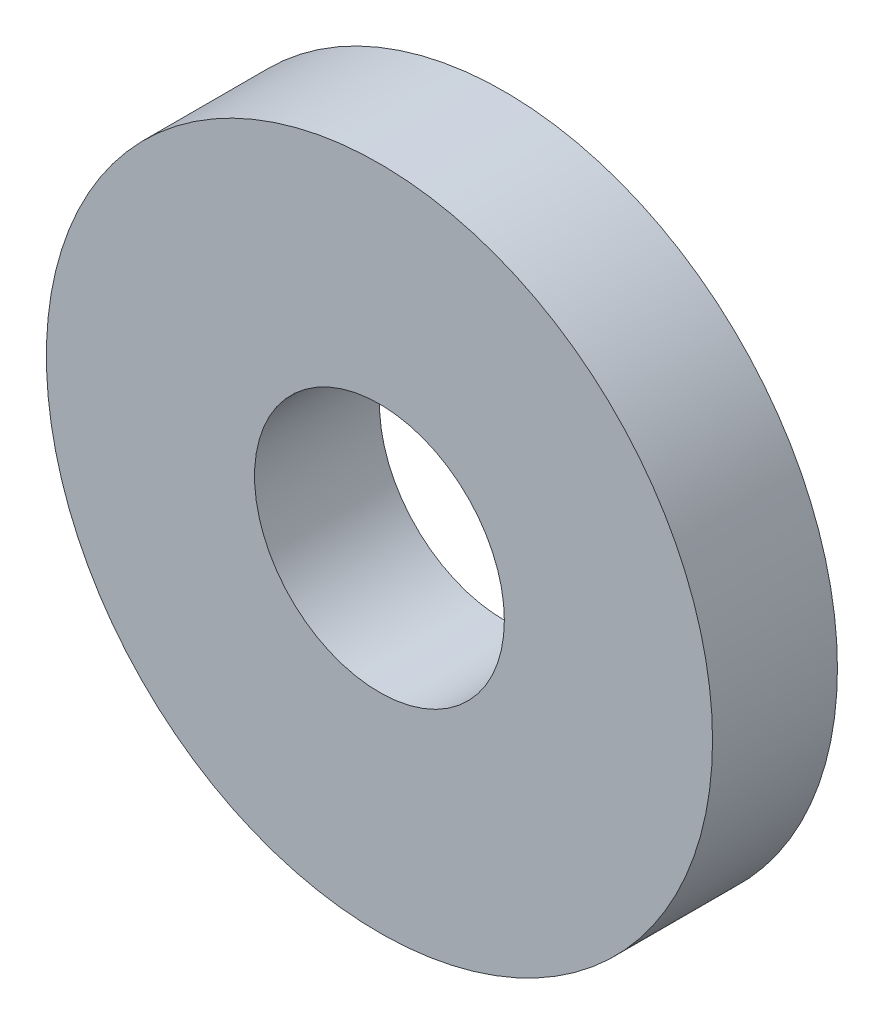
ISO-10303-21;
HEADER;
FILE_DESCRIPTION(('STEP AP214'),'2;1');
FILE_NAME('part.step','',(''),(''),'','','');
FILE_SCHEMA(('AUTOMOTIVE_DESIGN { 1 0 10303 214 1 1 1 1 }'));
ENDSEC;
DATA;
#1=APPLICATION_CONTEXT('core data for automotive mechanical design processes');
#2=APPLICATION_PROTOCOL_DEFINITION('international standard','automotive_design',2000,#1);
#3=PRODUCT_CONTEXT('',#1,'mechanical');
#4=PRODUCT('Part','Part','',(#3));
#5=PRODUCT_RELATED_PRODUCT_CATEGORY('part','',(#4));
#6=PRODUCT_DEFINITION_FORMATION('','',#4);
#7=PRODUCT_DEFINITION_CONTEXT('part definition',#1,'design');
#8=PRODUCT_DEFINITION('design','',#6,#7);
#9=PRODUCT_DEFINITION_SHAPE('','',#8);
#10=(LENGTH_UNIT() NAMED_UNIT(*) SI_UNIT(.MILLI.,.METRE.));
#11=(NAMED_UNIT(*) PLANE_ANGLE_UNIT() SI_UNIT($,.RADIAN.));
#12=(NAMED_UNIT(*) SI_UNIT($,.STERADIAN.) SOLID_ANGLE_UNIT());
#13=UNCERTAINTY_MEASURE_WITH_UNIT(LENGTH_MEASURE(1.E-05),#10,'distance_accuracy_value','');
#14=(GEOMETRIC_REPRESENTATION_CONTEXT(3) GLOBAL_UNCERTAINTY_ASSIGNED_CONTEXT((#13)) GLOBAL_UNIT_ASSIGNED_CONTEXT((#10,
#11,#12)) REPRESENTATION_CONTEXT('',''));
#15=CARTESIAN_POINT('',(0.,0.,0.));
#16=DIRECTION('',(0.,0.,1.));
#17=DIRECTION('',(1.,0.,0.));
#18=AXIS2_PLACEMENT_3D('',#15,#16,#17);
#19=CARTESIAN_POINT('',(0.,0.,19.05));
#20=DIRECTION('',(0.,0.,-1.));
#21=DIRECTION('',(-1.,0.,0.));
#22=AXIS2_PLACEMENT_3D('',#19,#20,#21);
#23=CYLINDRICAL_SURFACE('',#22,19.05);
#24=CARTESIAN_POINT('',(0.,0.,19.05));
#25=DIRECTION('',(0.,0.,1.));
#26=DIRECTION('',(1.,0.,0.));
#27=AXIS2_PLACEMENT_3D('',#24,#25,#26);
#28=CIRCLE('',#27,19.05);
#29=CARTESIAN_POINT('',(19.05,0.,19.05));
#30=VERTEX_POINT('',#29);
#31=EDGE_CURVE('E40',#30,#30,#28,.T.);
#32=ORIENTED_EDGE('',*,*,#31,.T.);
#33=EDGE_LOOP('',(#32));
#34=FACE_BOUND('',#33,.T.);
#35=CARTESIAN_POINT('',(0.,0.,0.));
#36=DIRECTION('',(0.,0.,1.));
#37=DIRECTION('',(1.,0.,0.));
#38=AXIS2_PLACEMENT_3D('',#35,#36,#37);
#39=CIRCLE('',#38,19.05);
#40=CARTESIAN_POINT('',(19.05,0.,0.));
#41=VERTEX_POINT('',#40);
#42=EDGE_CURVE('E46',#41,#41,#39,.T.);
#43=ORIENTED_EDGE('',*,*,#42,.F.);
#44=EDGE_LOOP('',(#43));
#45=FACE_BOUND('',#44,.T.);
#46=ADVANCED_FACE('F33',(#34,#45),#23,.F.);
#47=CARTESIAN_POINT('',(0.,0.,19.05));
#48=DIRECTION('',(0.,0.,-1.));
#49=DIRECTION('',(-1.,0.,0.));
#50=AXIS2_PLACEMENT_3D('',#47,#48,#49);
#51=CYLINDRICAL_SURFACE('',#50,50.8);
#52=CARTESIAN_POINT('',(0.,0.,19.05));
#53=DIRECTION('',(0.,0.,1.));
#54=DIRECTION('',(1.,0.,0.));
#55=AXIS2_PLACEMENT_3D('',#52,#53,#54);
#56=CIRCLE('',#55,50.8);
#57=CARTESIAN_POINT('',(50.8,0.,19.05));
#58=VERTEX_POINT('',#57);
#59=EDGE_CURVE('E10',#58,#58,#56,.T.);
#60=ORIENTED_EDGE('',*,*,#59,.F.);
#61=EDGE_LOOP('',(#60));
#62=FACE_BOUND('',#61,.T.);
#63=CARTESIAN_POINT('',(0.,0.,0.));
#64=DIRECTION('',(0.,0.,1.));
#65=DIRECTION('',(1.,0.,0.));
#66=AXIS2_PLACEMENT_3D('',#63,#64,#65);
#67=CIRCLE('',#66,50.8);
#68=CARTESIAN_POINT('',(50.8,0.,0.));
#69=VERTEX_POINT('',#68);
#70=EDGE_CURVE('E36',#69,#69,#67,.T.);
#71=ORIENTED_EDGE('',*,*,#70,.T.);
#72=EDGE_LOOP('',(#71));
#73=FACE_BOUND('',#72,.T.);
#74=ADVANCED_FACE('F53',(#62,#73),#51,.T.);
#75=CARTESIAN_POINT('',(0.,0.,19.05));
#76=DIRECTION('',(0.,0.,1.));
#77=DIRECTION('',(1.,0.,0.));
#78=AXIS2_PLACEMENT_3D('',#75,#76,#77);
#79=PLANE('',#78);
#80=ORIENTED_EDGE('',*,*,#31,.F.);
#81=EDGE_LOOP('',(#80));
#82=FACE_BOUND('',#81,.T.);
#83=ORIENTED_EDGE('',*,*,#59,.T.);
#84=EDGE_LOOP('',(#83));
#85=FACE_BOUND('',#84,.T.);
#86=ADVANCED_FACE('F57',(#82,#85),#79,.T.);
#87=CARTESIAN_POINT('',(0.,0.,0.));
#88=DIRECTION('',(0.,0.,1.));
#89=DIRECTION('',(1.,0.,0.));
#90=AXIS2_PLACEMENT_3D('',#87,#88,#89);
#91=PLANE('',#90);
#92=ORIENTED_EDGE('',*,*,#42,.T.);
#93=EDGE_LOOP('',(#92));
#94=FACE_BOUND('',#93,.T.);
#95=ORIENTED_EDGE('',*,*,#70,.F.);
#96=EDGE_LOOP('',(#95));
#97=FACE_BOUND('',#96,.T.);
#98=ADVANCED_FACE('F55',(#94,#97),#91,.F.);
#99=CLOSED_SHELL('',(#46,#74,#86,#98));
#100=MANIFOLD_SOLID_BREP('B2',#99);
#101=ADVANCED_BREP_SHAPE_REPRESENTATION('',(#18,#100),#14);
#102=SHAPE_DEFINITION_REPRESENTATION(#9,#101);
ENDSEC;
END-ISO-10303-21;
